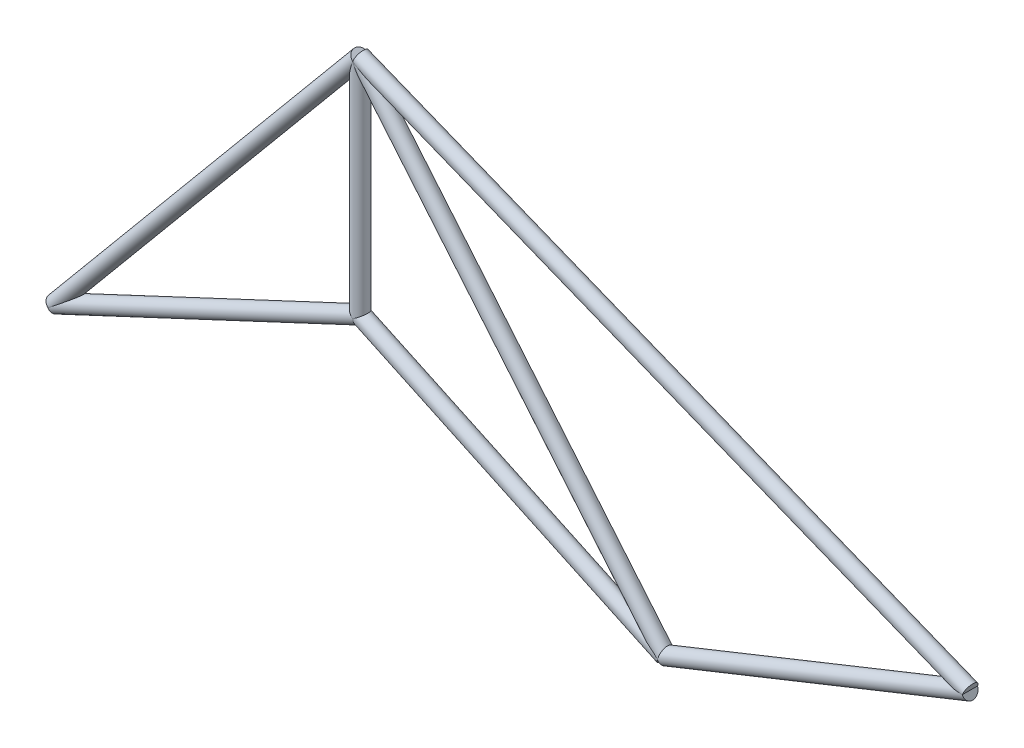
ISO-10303-21;
HEADER;
FILE_DESCRIPTION(('STEP AP214'),'2;1');
FILE_NAME('part.step','',(''),(''),'','','');
FILE_SCHEMA(('AUTOMOTIVE_DESIGN { 1 0 10303 214 1 1 1 1 }'));
ENDSEC;
DATA;
#1=APPLICATION_CONTEXT('core data for automotive mechanical design processes');
#2=APPLICATION_PROTOCOL_DEFINITION('international standard','automotive_design',2000,#1);
#3=PRODUCT_CONTEXT('',#1,'mechanical');
#4=PRODUCT('Part','Part','',(#3));
#5=PRODUCT_RELATED_PRODUCT_CATEGORY('part','',(#4));
#6=PRODUCT_DEFINITION_FORMATION('','',#4);
#7=PRODUCT_DEFINITION_CONTEXT('part definition',#1,'design');
#8=PRODUCT_DEFINITION('design','',#6,#7);
#9=PRODUCT_DEFINITION_SHAPE('','',#8);
#10=(LENGTH_UNIT() NAMED_UNIT(*) SI_UNIT(.MILLI.,.METRE.));
#11=(NAMED_UNIT(*) PLANE_ANGLE_UNIT() SI_UNIT($,.RADIAN.));
#12=(NAMED_UNIT(*) SI_UNIT($,.STERADIAN.) SOLID_ANGLE_UNIT());
#13=UNCERTAINTY_MEASURE_WITH_UNIT(LENGTH_MEASURE(1.E-05),#10,'distance_accuracy_value','');
#14=(GEOMETRIC_REPRESENTATION_CONTEXT(3) GLOBAL_UNCERTAINTY_ASSIGNED_CONTEXT((#13)) GLOBAL_UNIT_ASSIGNED_CONTEXT((#10,
#11,#12)) REPRESENTATION_CONTEXT('',''));
#15=CARTESIAN_POINT('',(0.,0.,0.));
#16=DIRECTION('',(0.,0.,1.));
#17=DIRECTION('',(1.,0.,0.));
#18=AXIS2_PLACEMENT_3D('',#15,#16,#17);
#19=CARTESIAN_POINT('',(2540.,1189.67236280048,0.));
#20=DIRECTION('',(0.,1.,0.));
#21=DIRECTION('',(-1.,0.,0.));
#22=AXIS2_PLACEMENT_3D('',#19,#20,#21);
#23=CYLINDRICAL_SURFACE('',#22,63.4999999999999);
#24=CARTESIAN_POINT('',(2540.,3048.,0.));
#25=DIRECTION('',(0.828067230469273,0.560628809305184,0.));
#26=DIRECTION('',(-0.560628809305184,0.828067230469273,0.));
#27=AXIS2_PLACEMENT_3D('',#24,#25,#26);
#28=ELLIPSE('',#27,113.265674089597,63.4999999999999);
#29=CARTESIAN_POINT('',(2540.,3048.,63.4999999999999));
#30=VERTEX_POINT('',#29);
#31=CARTESIAN_POINT('',(2540.,3048.,-63.4999999999999));
#32=VERTEX_POINT('',#31);
#33=EDGE_CURVE('E90',#30,#32,#28,.T.);
#34=ORIENTED_EDGE('',*,*,#33,.F.);
#35=CARTESIAN_POINT('',(2540.,3048.,0.));
#36=DIRECTION('',(-0.940271577683112,0.340425263753018,0.));
#37=DIRECTION('',(0.340425263753018,0.940271577683112,0.));
#38=AXIS2_PLACEMENT_3D('',#35,#36,#37);
#39=ELLIPSE('',#38,186.531396935539,63.4999999999999);
#40=EDGE_CURVE('E82',#32,#30,#39,.T.);
#41=ORIENTED_EDGE('',*,*,#40,.F.);
#42=EDGE_LOOP('',(#34,#41));
#43=FACE_BOUND('',#42,.T.);
#44=CARTESIAN_POINT('',(2540.,1189.67236280048,0.));
#45=DIRECTION('',(-0.536583918763075,0.843846963687647,0.));
#46=DIRECTION('',(0.843846963687647,0.536583918763075,0.));
#47=AXIS2_PLACEMENT_3D('',#44,#45,#46);
#48=ELLIPSE('',#47,75.2506114645506,63.4999999999999);
#49=CARTESIAN_POINT('',(2540.,1189.67236280048,-63.4999999999999));
#50=VERTEX_POINT('',#49);
#51=CARTESIAN_POINT('',(2540.,1189.67236280048,63.4999999999999));
#52=VERTEX_POINT('',#51);
#53=EDGE_CURVE('E86',#50,#52,#48,.F.);
#54=ORIENTED_EDGE('',*,*,#53,.F.);
#55=CARTESIAN_POINT('',(2540.,1189.67236280048,0.));
#56=DIRECTION('',(0.536583918763075,0.843846963687648,0.));
#57=DIRECTION('',(-0.843846963687648,0.536583918763075,0.));
#58=AXIS2_PLACEMENT_3D('',#55,#56,#57);
#59=ELLIPSE('',#58,75.2506114645506,63.4999999999999);
#60=EDGE_CURVE('E13',#52,#50,#59,.F.);
#61=ORIENTED_EDGE('',*,*,#60,.F.);
#62=EDGE_LOOP('',(#54,#61));
#63=FACE_BOUND('',#62,.T.);
#64=ADVANCED_FACE('F56',(#43,#63),#23,.T.);
#65=CARTESIAN_POINT('',(7620.,1016.,0.));
#66=DIRECTION('',(-0.928476690885259,0.371390676354104,0.));
#67=DIRECTION('',(-0.371390676354104,-0.928476690885259,0.));
#68=AXIS2_PLACEMENT_3D('',#65,#66,#67);
#69=CYLINDRICAL_SURFACE('',#68,63.4999999999999);
#70=ORIENTED_EDGE('',*,*,#33,.T.);
#71=CARTESIAN_POINT('',(2540.,3048.,0.));
#72=DIRECTION('',(-0.969460291496286,-0.245248329682256,0.));
#73=DIRECTION('',(-0.245248329682256,0.969460291496286,0.));
#74=AXIS2_PLACEMENT_3D('',#71,#72,#73);
#75=ELLIPSE('',#74,78.488245652144,63.4999999999999);
#76=EDGE_CURVE('E79',#32,#30,#75,.T.);
#77=ORIENTED_EDGE('',*,*,#76,.T.);
#78=EDGE_LOOP('',(#70,#77));
#79=FACE_BOUND('',#78,.T.);
#80=ADVANCED_FACE('F89',(#79),#69,.F.);
#81=CARTESIAN_POINT('',(2540.,3048.,0.));
#82=DIRECTION('',(-0.64018439966448,-0.768221279597376,0.));
#83=DIRECTION('',(0.768221279597376,-0.64018439966448,0.));
#84=AXIS2_PLACEMENT_3D('',#81,#82,#83);
#85=CYLINDRICAL_SURFACE('',#84,63.4999999999999);
#86=ORIENTED_EDGE('',*,*,#40,.T.);
#87=ORIENTED_EDGE('',*,*,#76,.F.);
#88=EDGE_LOOP('',(#86,#87));
#89=FACE_BOUND('',#88,.T.);
#90=ADVANCED_FACE('F83',(#89),#85,.F.);
#91=CARTESIAN_POINT('',(2540.,1189.67236280048,0.));
#92=DIRECTION('',(0.90558942122368,-0.424155396249724,0.));
#93=DIRECTION('',(0.424155396249724,0.90558942122368,0.));
#94=AXIS2_PLACEMENT_3D('',#91,#92,#93);
#95=CYLINDRICAL_SURFACE('',#94,63.4999999999999);
#96=ORIENTED_EDGE('',*,*,#53,.T.);
#97=CARTESIAN_POINT('',(2540.,1189.67236280048,0.));
#98=DIRECTION('',(-1.,0.,0.));
#99=DIRECTION('',(0.,-1.,0.));
#100=AXIS2_PLACEMENT_3D('',#97,#98,#99);
#101=ELLIPSE('',#100,70.1200770589782,63.4999999999999);
#102=EDGE_CURVE('E60',#52,#50,#101,.T.);
#103=ORIENTED_EDGE('',*,*,#102,.T.);
#104=EDGE_LOOP('',(#96,#103));
#105=FACE_BOUND('',#104,.T.);
#106=ADVANCED_FACE('F58',(#105),#95,.F.);
#107=CARTESIAN_POINT('',(0.,0.,0.));
#108=DIRECTION('',(0.90558942122368,0.424155396249724,0.));
#109=DIRECTION('',(-0.424155396249724,0.90558942122368,0.));
#110=AXIS2_PLACEMENT_3D('',#107,#108,#109);
#111=CYLINDRICAL_SURFACE('',#110,63.4999999999999);
#112=ORIENTED_EDGE('',*,*,#60,.T.);
#113=ORIENTED_EDGE('',*,*,#102,.F.);
#114=EDGE_LOOP('',(#112,#113));
#115=FACE_BOUND('',#114,.T.);
#116=ADVANCED_FACE('F97',(#115),#111,.F.);
#117=CLOSED_SHELL('',(#64,#80,#90,#106,#116));
#118=MANIFOLD_SOLID_BREP('B2',#117);
#119=CARTESIAN_POINT('',(5080.,0.,0.));
#120=DIRECTION('',(0.928476690885259,0.371390676354104,0.));
#121=DIRECTION('',(-0.371390676354104,0.928476690885259,0.));
#122=AXIS2_PLACEMENT_3D('',#119,#120,#121);
#123=CYLINDRICAL_SURFACE('',#122,63.4999999999999);
#124=CARTESIAN_POINT('',(5080.,-2.22044604925031E-13,0.));
#125=DIRECTION('',(0.969460291496286,-0.245248329682256,0.));
#126=DIRECTION('',(-0.245248329682256,-0.969460291496286,0.));
#127=AXIS2_PLACEMENT_3D('',#124,#125,#126);
#128=ELLIPSE('',#127,78.488245652144,63.4999999999999);
#129=CARTESIAN_POINT('',(5080.,-2.22044604925031E-13,-63.4999999999999));
#130=VERTEX_POINT('',#129);
#131=CARTESIAN_POINT('',(5080.,-2.22044604925031E-13,63.4999999999999));
#132=VERTEX_POINT('',#131);
#133=EDGE_CURVE('E209',#130,#132,#128,.T.);
#134=ORIENTED_EDGE('',*,*,#133,.T.);
#135=CARTESIAN_POINT('',(5080.,4.44089209850063E-13,0.));
#136=DIRECTION('',(0.999586421629187,-0.0287573589635115,0.));
#137=DIRECTION('',(-0.0287573589635115,-0.999586421629187,0.));
#138=AXIS2_PLACEMENT_3D('',#135,#136,#137);
#139=ELLIPSE('',#138,69.2164119432605,63.4999999999999);
#140=EDGE_CURVE('E200',#130,#132,#139,.T.);
#141=ORIENTED_EDGE('',*,*,#140,.F.);
#142=EDGE_LOOP('',(#134,#141));
#143=FACE_BOUND('',#142,.T.);
#144=ADVANCED_FACE('F180',(#143),#123,.F.);
#145=CARTESIAN_POINT('',(2540.,1189.67236280048,0.));
#146=DIRECTION('',(0.90558942122368,-0.424155396249724,0.));
#147=DIRECTION('',(0.424155396249724,0.90558942122368,0.));
#148=AXIS2_PLACEMENT_3D('',#145,#146,#147);
#149=CYLINDRICAL_SURFACE('',#148,63.4999999999999);
#150=CARTESIAN_POINT('',(5080.,1.33226762955019E-12,0.));
#151=DIRECTION('',(-0.61077859379914,-0.791801433035294,0.));
#152=DIRECTION('',(0.791801433035294,-0.61077859379914,0.));
#153=AXIS2_PLACEMENT_3D('',#150,#151,#152);
#154=ELLIPSE('',#153,292.266065490356,63.4999999999999);
#155=EDGE_CURVE('E212',#132,#130,#154,.T.);
#156=ORIENTED_EDGE('',*,*,#155,.T.);
#157=ORIENTED_EDGE('',*,*,#140,.T.);
#158=EDGE_LOOP('',(#156,#157));
#159=FACE_BOUND('',#158,.T.);
#160=ADVANCED_FACE('F182',(#159),#149,.F.);
#161=CARTESIAN_POINT('',(2540.,3048.,0.));
#162=DIRECTION('',(0.64018439966448,-0.768221279597376,0.));
#163=DIRECTION('',(0.768221279597376,0.64018439966448,0.));
#164=AXIS2_PLACEMENT_3D('',#161,#162,#163);
#165=CYLINDRICAL_SURFACE('',#164,63.4999999999999);
#166=ORIENTED_EDGE('',*,*,#155,.F.);
#167=ORIENTED_EDGE('',*,*,#133,.F.);
#168=EDGE_LOOP('',(#166,#167));
#169=FACE_BOUND('',#168,.T.);
#170=CARTESIAN_POINT('',(2539.99999999999,3048.00000000001,0.));
#171=DIRECTION('',(-0.58775587094577,-0.809038340357723,0.));
#172=DIRECTION('',(0.809038340357723,-0.58775587094577,0.));
#173=AXIS2_PLACEMENT_3D('',#170,#171,#172);
#174=ELLIPSE('',#173,258.921233356699,63.4999999999999);
#175=CARTESIAN_POINT('',(2540.,3048.,63.4999999999999));
#176=VERTEX_POINT('',#175);
#177=CARTESIAN_POINT('',(2540.,3048.,-63.4999999999999));
#178=VERTEX_POINT('',#177);
#179=EDGE_CURVE('E54',#176,#178,#174,.F.);
#180=ORIENTED_EDGE('',*,*,#179,.F.);
#181=CARTESIAN_POINT('',(2540.,3048.,0.));
#182=DIRECTION('',(1.,0.,0.));
#183=DIRECTION('',(0.,-1.,0.));
#184=AXIS2_PLACEMENT_3D('',#181,#182,#183);
#185=ELLIPSE('',#184,99.1901708840143,63.4999999999999);
#186=EDGE_CURVE('E188',#178,#176,#185,.F.);
#187=ORIENTED_EDGE('',*,*,#186,.F.);
#188=EDGE_LOOP('',(#180,#187));
#189=FACE_BOUND('',#188,.T.);
#190=ADVANCED_FACE('F214',(#169,#189),#165,.T.);
#191=CARTESIAN_POINT('',(2540.,3048.,0.));
#192=DIRECTION('',(-0.64018439966448,-0.768221279597376,0.));
#193=DIRECTION('',(0.768221279597376,-0.64018439966448,0.));
#194=AXIS2_PLACEMENT_3D('',#191,#192,#193);
#195=CYLINDRICAL_SURFACE('',#194,63.4999999999999);
#196=ORIENTED_EDGE('',*,*,#186,.T.);
#197=CARTESIAN_POINT('',(2540.,3048.,0.));
#198=DIRECTION('',(-0.969460291496286,-0.245248329682256,0.));
#199=DIRECTION('',(-0.245248329682256,0.969460291496286,0.));
#200=AXIS2_PLACEMENT_3D('',#197,#198,#199);
#201=ELLIPSE('',#200,78.488245652144,63.4999999999999);
#202=EDGE_CURVE('E194',#178,#176,#201,.T.);
#203=ORIENTED_EDGE('',*,*,#202,.F.);
#204=EDGE_LOOP('',(#196,#203));
#205=FACE_BOUND('',#204,.T.);
#206=ADVANCED_FACE('F206',(#205),#195,.F.);
#207=CARTESIAN_POINT('',(7620.,1016.,0.));
#208=DIRECTION('',(-0.928476690885259,0.371390676354104,0.));
#209=DIRECTION('',(-0.371390676354104,-0.928476690885259,0.));
#210=AXIS2_PLACEMENT_3D('',#207,#208,#209);
#211=CYLINDRICAL_SURFACE('',#210,63.4999999999999);
#212=ORIENTED_EDGE('',*,*,#179,.T.);
#213=ORIENTED_EDGE('',*,*,#202,.T.);
#214=EDGE_LOOP('',(#212,#213));
#215=FACE_BOUND('',#214,.T.);
#216=ADVANCED_FACE('F211',(#215),#211,.F.);
#217=CLOSED_SHELL('',(#144,#160,#190,#206,#216));
#218=MANIFOLD_SOLID_BREP('B7',#217);
#219=CARTESIAN_POINT('',(2540.,1189.67236280048,0.));
#220=DIRECTION('',(0.90558942122368,-0.424155396249724,0.));
#221=DIRECTION('',(0.424155396249724,0.90558942122368,0.));
#222=AXIS2_PLACEMENT_3D('',#219,#220,#221);
#223=CYLINDRICAL_SURFACE('',#222,63.4999999999999);
#224=CARTESIAN_POINT('',(2540.,1189.67236280048,0.));
#225=DIRECTION('',(-0.905589421223681,0.424155396249724,0.));
#226=DIRECTION('',(-0.424155396249724,-0.905589421223681,0.));
#227=AXIS2_PLACEMENT_3D('',#224,#225,#226);
#228=CIRCLE('',#227,63.4999999999999);
#229=CARTESIAN_POINT('',(2513.06613233814,1132.16743455278,0.));
#230=VERTEX_POINT('',#229);
#231=EDGE_CURVE('E179',#230,#230,#228,.T.);
#232=ORIENTED_EDGE('',*,*,#231,.F.);
#233=EDGE_LOOP('',(#232));
#234=FACE_BOUND('',#233,.T.);
#235=CARTESIAN_POINT('',(5080.,-1.11022302462516E-13,0.));
#236=DIRECTION('',(-0.905589421223681,0.424155396249724,0.));
#237=DIRECTION('',(-0.424155396249724,-0.905589421223681,0.));
#238=AXIS2_PLACEMENT_3D('',#235,#236,#237);
#239=CIRCLE('',#238,63.4999999999999);
#240=CARTESIAN_POINT('',(5053.06613233814,-57.5049282477038,0.));
#241=VERTEX_POINT('',#240);
#242=EDGE_CURVE('E308',#241,#241,#239,.T.);
#243=ORIENTED_EDGE('',*,*,#242,.T.);
#244=EDGE_LOOP('',(#243));
#245=FACE_BOUND('',#244,.T.);
#246=ADVANCED_FACE('F305',(#234,#245),#223,.T.);
#247=CARTESIAN_POINT('',(2540.,1189.67236280048,0.));
#248=DIRECTION('',(-0.905589421223681,0.424155396249724,0.));
#249=DIRECTION('',(-0.424155396249724,-0.905589421223681,0.));
#250=AXIS2_PLACEMENT_3D('',#247,#248,#249);
#251=PLANE('',#250);
#252=ORIENTED_EDGE('',*,*,#231,.T.);
#253=EDGE_LOOP('',(#252));
#254=FACE_BOUND('',#253,.T.);
#255=ADVANCED_FACE('F320',(#254),#251,.T.);
#256=CARTESIAN_POINT('',(5080.,-1.11022302462516E-13,0.));
#257=DIRECTION('',(-0.905589421223681,0.424155396249724,0.));
#258=DIRECTION('',(-0.424155396249724,-0.905589421223681,0.));
#259=AXIS2_PLACEMENT_3D('',#256,#257,#258);
#260=PLANE('',#259);
#261=ORIENTED_EDGE('',*,*,#242,.F.);
#262=EDGE_LOOP('',(#261));
#263=FACE_BOUND('',#262,.T.);
#264=ADVANCED_FACE('F318',(#263),#260,.F.);
#265=CLOSED_SHELL('',(#246,#255,#264));
#266=MANIFOLD_SOLID_BREP('B48',#265);
#267=CARTESIAN_POINT('',(5080.,0.,0.));
#268=DIRECTION('',(0.928476690885259,0.371390676354104,0.));
#269=DIRECTION('',(-0.371390676354104,0.928476690885259,0.));
#270=AXIS2_PLACEMENT_3D('',#267,#268,#269);
#271=CYLINDRICAL_SURFACE('',#270,63.4999999999999);
#272=CARTESIAN_POINT('',(5080.,0.,0.));
#273=DIRECTION('',(-0.928476690885259,-0.371390676354104,0.));
#274=DIRECTION('',(0.371390676354104,-0.928476690885259,0.));
#275=AXIS2_PLACEMENT_3D('',#272,#273,#274);
#276=CIRCLE('',#275,63.4999999999999);
#277=CARTESIAN_POINT('',(5103.58330794849,-58.9582698712139,0.));
#278=VERTEX_POINT('',#277);
#279=EDGE_CURVE('E304',#278,#278,#276,.T.);
#280=ORIENTED_EDGE('',*,*,#279,.F.);
#281=EDGE_LOOP('',(#280));
#282=FACE_BOUND('',#281,.T.);
#283=CARTESIAN_POINT('',(7620.,1016.,0.));
#284=DIRECTION('',(-0.928476690885259,-0.371390676354104,0.));
#285=DIRECTION('',(0.371390676354104,-0.928476690885259,0.));
#286=AXIS2_PLACEMENT_3D('',#283,#284,#285);
#287=CIRCLE('',#286,63.4999999999999);
#288=CARTESIAN_POINT('',(7643.58330794849,957.041730128786,0.));
#289=VERTEX_POINT('',#288);
#290=EDGE_CURVE('E362',#289,#289,#287,.T.);
#291=ORIENTED_EDGE('',*,*,#290,.T.);
#292=EDGE_LOOP('',(#291));
#293=FACE_BOUND('',#292,.T.);
#294=ADVANCED_FACE('F359',(#282,#293),#271,.T.);
#295=CARTESIAN_POINT('',(5080.,0.,0.));
#296=DIRECTION('',(-0.928476690885259,-0.371390676354104,0.));
#297=DIRECTION('',(0.371390676354104,-0.928476690885259,0.));
#298=AXIS2_PLACEMENT_3D('',#295,#296,#297);
#299=PLANE('',#298);
#300=ORIENTED_EDGE('',*,*,#279,.T.);
#301=EDGE_LOOP('',(#300));
#302=FACE_BOUND('',#301,.T.);
#303=ADVANCED_FACE('F374',(#302),#299,.T.);
#304=CARTESIAN_POINT('',(7620.,1016.,0.));
#305=DIRECTION('',(-0.928476690885259,-0.371390676354104,0.));
#306=DIRECTION('',(0.371390676354104,-0.928476690885259,0.));
#307=AXIS2_PLACEMENT_3D('',#304,#305,#306);
#308=PLANE('',#307);
#309=ORIENTED_EDGE('',*,*,#290,.F.);
#310=EDGE_LOOP('',(#309));
#311=FACE_BOUND('',#310,.T.);
#312=ADVANCED_FACE('F372',(#311),#308,.F.);
#313=CLOSED_SHELL('',(#294,#303,#312));
#314=MANIFOLD_SOLID_BREP('B174',#313);
#315=CARTESIAN_POINT('',(7620.,1016.,0.));
#316=DIRECTION('',(-0.928476690885259,0.371390676354104,0.));
#317=DIRECTION('',(-0.371390676354104,-0.928476690885259,0.));
#318=AXIS2_PLACEMENT_3D('',#315,#316,#317);
#319=CYLINDRICAL_SURFACE('',#318,63.4999999999999);
#320=CARTESIAN_POINT('',(7620.,1016.,0.));
#321=DIRECTION('',(0.928476690885259,-0.371390676354104,0.));
#322=DIRECTION('',(0.371390676354104,0.928476690885259,0.));
#323=AXIS2_PLACEMENT_3D('',#320,#321,#322);
#324=CIRCLE('',#323,63.4999999999999);
#325=CARTESIAN_POINT('',(7643.58330794848,1074.95826987121,0.));
#326=VERTEX_POINT('',#325);
#327=EDGE_CURVE('E358',#326,#326,#324,.T.);
#328=ORIENTED_EDGE('',*,*,#327,.F.);
#329=EDGE_LOOP('',(#328));
#330=FACE_BOUND('',#329,.T.);
#331=CARTESIAN_POINT('',(2540.,3048.,0.));
#332=DIRECTION('',(0.928476690885259,-0.371390676354104,0.));
#333=DIRECTION('',(0.371390676354104,0.928476690885259,0.));
#334=AXIS2_PLACEMENT_3D('',#331,#332,#333);
#335=CIRCLE('',#334,63.4999999999999);
#336=CARTESIAN_POINT('',(2563.58330794849,3106.95826987121,0.));
#337=VERTEX_POINT('',#336);
#338=EDGE_CURVE('E416',#337,#337,#335,.T.);
#339=ORIENTED_EDGE('',*,*,#338,.T.);
#340=EDGE_LOOP('',(#339));
#341=FACE_BOUND('',#340,.T.);
#342=ADVANCED_FACE('F413',(#330,#341),#319,.T.);
#343=CARTESIAN_POINT('',(7620.,1016.,0.));
#344=DIRECTION('',(0.928476690885259,-0.371390676354104,0.));
#345=DIRECTION('',(0.371390676354104,0.928476690885259,0.));
#346=AXIS2_PLACEMENT_3D('',#343,#344,#345);
#347=PLANE('',#346);
#348=ORIENTED_EDGE('',*,*,#327,.T.);
#349=EDGE_LOOP('',(#348));
#350=FACE_BOUND('',#349,.T.);
#351=ADVANCED_FACE('F428',(#350),#347,.T.);
#352=CARTESIAN_POINT('',(2540.,3048.,0.));
#353=DIRECTION('',(0.928476690885259,-0.371390676354104,0.));
#354=DIRECTION('',(0.371390676354104,0.928476690885259,0.));
#355=AXIS2_PLACEMENT_3D('',#352,#353,#354);
#356=PLANE('',#355);
#357=ORIENTED_EDGE('',*,*,#338,.F.);
#358=EDGE_LOOP('',(#357));
#359=FACE_BOUND('',#358,.T.);
#360=ADVANCED_FACE('F426',(#359),#356,.F.);
#361=CLOSED_SHELL('',(#342,#351,#360));
#362=MANIFOLD_SOLID_BREP('B299',#361);
#363=CARTESIAN_POINT('',(2540.,3048.,0.));
#364=DIRECTION('',(-0.64018439966448,-0.768221279597376,0.));
#365=DIRECTION('',(0.768221279597376,-0.64018439966448,0.));
#366=AXIS2_PLACEMENT_3D('',#363,#364,#365);
#367=CYLINDRICAL_SURFACE('',#366,63.4999999999999);
#368=CARTESIAN_POINT('',(2540.,3048.,0.));
#369=DIRECTION('',(0.64018439966448,0.768221279597376,0.));
#370=DIRECTION('',(-0.768221279597376,0.64018439966448,0.));
#371=AXIS2_PLACEMENT_3D('',#368,#369,#370);
#372=CIRCLE('',#371,63.4999999999999);
#373=CARTESIAN_POINT('',(2491.21794874557,3088.65170937869,0.));
#374=VERTEX_POINT('',#373);
#375=EDGE_CURVE('E412',#374,#374,#372,.T.);
#376=ORIENTED_EDGE('',*,*,#375,.F.);
#377=EDGE_LOOP('',(#376));
#378=FACE_BOUND('',#377,.T.);
#379=CARTESIAN_POINT('',(0.,0.,0.));
#380=DIRECTION('',(0.64018439966448,0.768221279597376,0.));
#381=DIRECTION('',(-0.768221279597376,0.64018439966448,0.));
#382=AXIS2_PLACEMENT_3D('',#379,#380,#381);
#383=CIRCLE('',#382,63.4999999999999);
#384=CARTESIAN_POINT('',(-48.7820512544333,40.6517093786944,0.));
#385=VERTEX_POINT('',#384);
#386=EDGE_CURVE('E469',#385,#385,#383,.T.);
#387=ORIENTED_EDGE('',*,*,#386,.T.);
#388=EDGE_LOOP('',(#387));
#389=FACE_BOUND('',#388,.T.);
#390=ADVANCED_FACE('F466',(#378,#389),#367,.T.);
#391=CARTESIAN_POINT('',(2540.,3048.,0.));
#392=DIRECTION('',(0.64018439966448,0.768221279597376,0.));
#393=DIRECTION('',(-0.768221279597376,0.64018439966448,0.));
#394=AXIS2_PLACEMENT_3D('',#391,#392,#393);
#395=PLANE('',#394);
#396=ORIENTED_EDGE('',*,*,#375,.T.);
#397=EDGE_LOOP('',(#396));
#398=FACE_BOUND('',#397,.T.);
#399=ADVANCED_FACE('F481',(#398),#395,.T.);
#400=CARTESIAN_POINT('',(0.,0.,0.));
#401=DIRECTION('',(0.64018439966448,0.768221279597376,0.));
#402=DIRECTION('',(-0.768221279597376,0.64018439966448,0.));
#403=AXIS2_PLACEMENT_3D('',#400,#401,#402);
#404=PLANE('',#403);
#405=ORIENTED_EDGE('',*,*,#386,.F.);
#406=EDGE_LOOP('',(#405));
#407=FACE_BOUND('',#406,.T.);
#408=ADVANCED_FACE('F479',(#407),#404,.F.);
#409=CLOSED_SHELL('',(#390,#399,#408));
#410=MANIFOLD_SOLID_BREP('B353',#409);
#411=CARTESIAN_POINT('',(-4.44089209850063E-13,-2.22044604925031E-13,0.));
#412=DIRECTION('',(0.90558942122368,0.424155396249724,0.));
#413=DIRECTION('',(-0.424155396249724,0.90558942122368,0.));
#414=AXIS2_PLACEMENT_3D('',#411,#412,#413);
#415=CYLINDRICAL_SURFACE('',#414,63.4999999999999);
#416=CARTESIAN_POINT('',(-4.44089209850063E-13,-2.22044604925031E-13,0.));
#417=DIRECTION('',(-0.90558942122368,-0.424155396249724,0.));
#418=DIRECTION('',(0.424155396249724,-0.90558942122368,0.));
#419=AXIS2_PLACEMENT_3D('',#416,#417,#418);
#420=CIRCLE('',#419,63.4999999999999);
#421=CARTESIAN_POINT('',(26.933867661857,-57.5049282477038,0.));
#422=VERTEX_POINT('',#421);
#423=EDGE_CURVE('E465',#422,#422,#420,.T.);
#424=ORIENTED_EDGE('',*,*,#423,.F.);
#425=EDGE_LOOP('',(#424));
#426=FACE_BOUND('',#425,.T.);
#427=CARTESIAN_POINT('',(2540.,1189.67236280048,0.));
#428=DIRECTION('',(-0.90558942122368,-0.424155396249724,0.));
#429=DIRECTION('',(0.424155396249724,-0.90558942122368,0.));
#430=AXIS2_PLACEMENT_3D('',#427,#428,#429);
#431=CIRCLE('',#430,63.4999999999999);
#432=CARTESIAN_POINT('',(2566.93386766186,1132.16743455278,0.));
#433=VERTEX_POINT('',#432);
#434=EDGE_CURVE('E515',#433,#433,#431,.T.);
#435=ORIENTED_EDGE('',*,*,#434,.T.);
#436=EDGE_LOOP('',(#435));
#437=FACE_BOUND('',#436,.T.);
#438=ADVANCED_FACE('F512',(#426,#437),#415,.T.);
#439=CARTESIAN_POINT('',(-4.44089209850063E-13,-2.22044604925031E-13,0.));
#440=DIRECTION('',(-0.90558942122368,-0.424155396249724,0.));
#441=DIRECTION('',(0.424155396249724,-0.90558942122368,0.));
#442=AXIS2_PLACEMENT_3D('',#439,#440,#441);
#443=PLANE('',#442);
#444=ORIENTED_EDGE('',*,*,#423,.T.);
#445=EDGE_LOOP('',(#444));
#446=FACE_BOUND('',#445,.T.);
#447=ADVANCED_FACE('F527',(#446),#443,.T.);
#448=CARTESIAN_POINT('',(2540.,1189.67236280048,0.));
#449=DIRECTION('',(-0.90558942122368,-0.424155396249724,0.));
#450=DIRECTION('',(0.424155396249724,-0.90558942122368,0.));
#451=AXIS2_PLACEMENT_3D('',#448,#449,#450);
#452=PLANE('',#451);
#453=ORIENTED_EDGE('',*,*,#434,.F.);
#454=EDGE_LOOP('',(#453));
#455=FACE_BOUND('',#454,.T.);
#456=ADVANCED_FACE('F525',(#455),#452,.F.);
#457=CLOSED_SHELL('',(#438,#447,#456));
#458=MANIFOLD_SOLID_BREP('B407',#457);
#459=ADVANCED_BREP_SHAPE_REPRESENTATION('',(#18,#118,#218,#266,#314,#362,#410,#458),#14);
#460=SHAPE_DEFINITION_REPRESENTATION(#9,#459);
ENDSEC;
END-ISO-10303-21;
